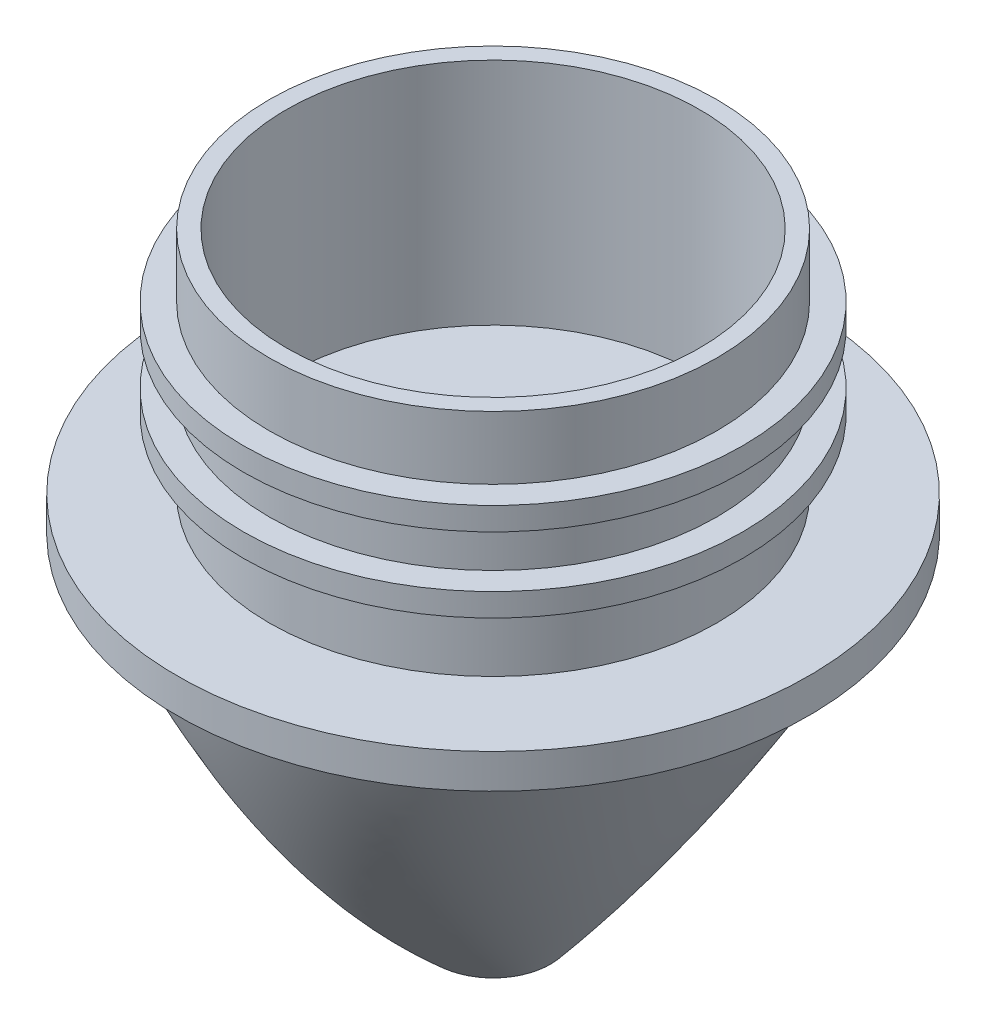
ISO-10303-21;
HEADER;
FILE_DESCRIPTION(('STEP AP214'),'2;1');
FILE_NAME('part.step','',(''),(''),'','','');
FILE_SCHEMA(('AUTOMOTIVE_DESIGN { 1 0 10303 214 1 1 1 1 }'));
ENDSEC;
DATA;
#1=APPLICATION_CONTEXT('core data for automotive mechanical design processes');
#2=APPLICATION_PROTOCOL_DEFINITION('international standard','automotive_design',2000,#1);
#3=PRODUCT_CONTEXT('',#1,'mechanical');
#4=PRODUCT('Part','Part','',(#3));
#5=PRODUCT_RELATED_PRODUCT_CATEGORY('part','',(#4));
#6=PRODUCT_DEFINITION_FORMATION('','',#4);
#7=PRODUCT_DEFINITION_CONTEXT('part definition',#1,'design');
#8=PRODUCT_DEFINITION('design','',#6,#7);
#9=PRODUCT_DEFINITION_SHAPE('','',#8);
#10=(LENGTH_UNIT() NAMED_UNIT(*) SI_UNIT(.MILLI.,.METRE.));
#11=(NAMED_UNIT(*) PLANE_ANGLE_UNIT() SI_UNIT($,.RADIAN.));
#12=(NAMED_UNIT(*) SI_UNIT($,.STERADIAN.) SOLID_ANGLE_UNIT());
#13=UNCERTAINTY_MEASURE_WITH_UNIT(LENGTH_MEASURE(1.E-05),#10,'distance_accuracy_value','');
#14=(GEOMETRIC_REPRESENTATION_CONTEXT(3) GLOBAL_UNCERTAINTY_ASSIGNED_CONTEXT((#13)) GLOBAL_UNIT_ASSIGNED_CONTEXT((#10,
#11,#12)) REPRESENTATION_CONTEXT('',''));
#15=CARTESIAN_POINT('',(0.,0.,0.));
#16=DIRECTION('',(0.,0.,1.));
#17=DIRECTION('',(1.,0.,0.));
#18=AXIS2_PLACEMENT_3D('',#15,#16,#17);
#19=CARTESIAN_POINT('',(0.,-23.4034123059416,-1.68146346259813));
#20=DIRECTION('',(-1.,0.,0.));
#21=DIRECTION('',(0.,0.,1.));
#22=AXIS2_PLACEMENT_3D('',#19,#20,#21);
#23=CIRCLE('',#22,11.6934361661484);
#24=TRIMMED_CURVE('',#23,(PARAMETER_VALUE(-1.42650061481023)),
(PARAMETER_VALUE(1.42650061481023)),.T.,.PARAMETER.);
#25=CARTESIAN_POINT('',(0.,-23.4034123059416,0.));
#26=DIRECTION('',(0.,1.,0.));
#27=AXIS1_PLACEMENT('',#25,#26);
#28=SURFACE_OF_REVOLUTION('',#24,#27);
#29=CARTESIAN_POINT('',(0.,-34.9753235567132,0.));
#30=VERTEX_POINT('',#29);
#31=VERTEX_LOOP('',#30);
#32=FACE_BOUND('',#31,.T.);
#33=CARTESIAN_POINT('',(0.,-33.,0.));
#34=DIRECTION('',(0.,1.,0.));
#35=DIRECTION('',(0.,0.,1.));
#36=AXIS2_PLACEMENT_3D('',#33,#34,#35);
#37=CIRCLE('',#36,5.);
#38=CARTESIAN_POINT('',(0.,-33.,5.));
#39=VERTEX_POINT('',#38);
#40=EDGE_CURVE('E14',#39,#39,#37,.T.);
#41=ORIENTED_EDGE('',*,*,#40,.F.);
#42=EDGE_LOOP('',(#41));
#43=FACE_BOUND('',#42,.T.);
#44=ADVANCED_FACE('F95',(#32,#43),#28,.T.);
#45=CARTESIAN_POINT('',(0.,-33.,5.));
#46=DIRECTION('',(0.,1.,0.));
#47=DIRECTION('',(0.,0.,1.));
#48=AXIS2_PLACEMENT_3D('',#45,#46,#47);
#49=PLANE('',#48);
#50=ORIENTED_EDGE('',*,*,#40,.T.);
#51=EDGE_LOOP('',(#50));
#52=FACE_BOUND('',#51,.T.);
#53=ADVANCED_FACE('F104',(#52),#49,.T.);
#54=CLOSED_SHELL('',(#44,#53));
#55=MANIFOLD_SOLID_BREP('B2',#54);
#56=CARTESIAN_POINT('',(0.,-33.,-5.));
#57=DIRECTION('',(0.,1.,-1.06741180562796E-13));
#58=DIRECTION('',(0.,1.06741180562796E-13,1.));
#59=AXIS2_PLACEMENT_3D('',#56,#57,#58);
#60=PLANE('',#59);
#61=CARTESIAN_POINT('',(0.,-33.,5.));
#62=CARTESIAN_POINT('',(-0.327249232137514,-33.,5.));
#63=CARTESIAN_POINT('',(-0.981680403977716,-33.,4.93499328124983));
#64=CARTESIAN_POINT('',(-2.24064053377986,-33.,4.55458579852169));
#65=CARTESIAN_POINT('',(-3.62771208725025,-32.9999999999999,3.62764916613364));
#66=CARTESIAN_POINT('',(-4.73979573179852,-33.,1.9633506312621));
#67=CARTESIAN_POINT('',(-5.13036592541444,-32.9999999999999,0.));
#68=CARTESIAN_POINT('',(-4.73979573179851,-33.0000000000001,-1.9633506312621));
#69=CARTESIAN_POINT('',(-3.62771208725026,-32.9999999999999,-3.62764916613364));
#70=CARTESIAN_POINT('',(-2.24064053377986,-33.,-4.55458579852169));
#71=CARTESIAN_POINT('',(-0.981680403977716,-33.,-4.93499328124983));
#72=CARTESIAN_POINT('',(-0.327249232137514,-33.,-5.));
#73=CARTESIAN_POINT('',(0.327249232137514,-33.,-5.));
#74=CARTESIAN_POINT('',(0.981680403977717,-33.,-4.93499328124983));
#75=CARTESIAN_POINT('',(2.24064053377986,-33.,-4.5545857985217));
#76=CARTESIAN_POINT('',(3.62771208725025,-32.9999999999999,-3.62764916613363));
#77=CARTESIAN_POINT('',(4.73979573179853,-33.,-1.9633506312621));
#78=CARTESIAN_POINT('',(5.13036592541442,-33.,0.));
#79=CARTESIAN_POINT('',(4.73979573179853,-33.,1.9633506312621));
#80=CARTESIAN_POINT('',(3.62771208725025,-33.,3.62764916613364));
#81=CARTESIAN_POINT('',(2.24064053377986,-33.,4.55458579852169));
#82=CARTESIAN_POINT('',(0.981680403977717,-33.,4.93499328124983));
#83=CARTESIAN_POINT('',(0.327249232137515,-33.,5.));
#84=CARTESIAN_POINT('',(0.,-33.,5.));
#85=B_SPLINE_CURVE_WITH_KNOTS('',3,(#61,#62,#63,#64,#65,#66,#67,#68,#69,#70,#71,#72,#73,#74,#75,
#76,#77,#78,#79,#80,#81,#82,#83,#84),.UNSPECIFIED.,.T.,.F.,(4,1,1,1,1,1,1,1,1,1,2,1,1,1,1,1,1,1,
1,1,4),(0.,0.03125,0.0625,0.125,0.1875,0.25,0.3125,0.375,0.4375,0.46875,0.5,0.53125,0.5625,
0.625,0.6875,0.75,0.8125,0.875,0.9375,0.96875,1.),.UNSPECIFIED.);
#86=CARTESIAN_POINT('',(0.,-33.,5.));
#87=VERTEX_POINT('',#86);
#88=EDGE_CURVE('E132',#87,#87,#85,.F.);
#89=ORIENTED_EDGE('',*,*,#88,.F.);
#90=EDGE_LOOP('',(#89));
#91=FACE_BOUND('',#90,.T.);
#92=ADVANCED_FACE('F129',(#91),#60,.F.);
#93=CARTESIAN_POINT('',(0.,-3.,-25.));
#94=DIRECTION('',(0.,1.,0.));
#95=DIRECTION('',(0.,0.,1.));
#96=AXIS2_PLACEMENT_3D('',#93,#94,#95);
#97=PLANE('',#96);
#98=CARTESIAN_POINT('',(0.,-3.,25.));
#99=CARTESIAN_POINT('',(-1.63624616068757,-3.,25.));
#100=CARTESIAN_POINT('',(-4.90813549192513,-3.,24.6765838751217));
#101=CARTESIAN_POINT('',(-11.2035179919908,-2.99999999999999,22.7715638139233));
#102=CARTESIAN_POINT('',(-18.1384091942729,-3.00000000000001,18.1389749409526));
#103=CARTESIAN_POINT('',(-23.6992576262852,-3.,9.81635374424561));
#104=CARTESIAN_POINT('',(-25.6515460302529,-2.99999999999999,0.));
#105=CARTESIAN_POINT('',(-23.6992576262853,-3.00000000000001,-9.81635374424557));
#106=CARTESIAN_POINT('',(-18.1384091942729,-3.,-18.1389749409527));
#107=CARTESIAN_POINT('',(-11.2035179919908,-3.,-22.7715638139232));
#108=CARTESIAN_POINT('',(-4.90813549192511,-3.,-24.6765838751217));
#109=CARTESIAN_POINT('',(-1.63624616068757,-3.,-25.));
#110=CARTESIAN_POINT('',(1.63624616068757,-3.,-25.));
#111=CARTESIAN_POINT('',(4.90813549192511,-3.,-24.6765838751217));
#112=CARTESIAN_POINT('',(11.2035179919908,-3.,-22.7715638139232));
#113=CARTESIAN_POINT('',(18.1384091942728,-3.,-18.1389749409527));
#114=CARTESIAN_POINT('',(23.6992576262853,-3.00000000000001,-9.81635374424558));
#115=CARTESIAN_POINT('',(25.6515460302528,-2.99999999999999,0.));
#116=CARTESIAN_POINT('',(23.6992576262852,-3.00000000000001,9.81635374424565));
#117=CARTESIAN_POINT('',(18.1384091942729,-3.,18.1389749409526));
#118=CARTESIAN_POINT('',(11.2035179919908,-3.00000000000001,22.7715638139233));
#119=CARTESIAN_POINT('',(4.90813549192513,-3.,24.6765838751217));
#120=CARTESIAN_POINT('',(1.63624616068757,-3.,25.));
#121=CARTESIAN_POINT('',(0.,-3.,25.));
#122=B_SPLINE_CURVE_WITH_KNOTS('',3,(#98,#99,#100,#101,#102,#103,#104,#105,#106,#107,#108,#109,
#110,#111,#112,#113,#114,#115,#116,#117,#118,#119,#120,#121),.UNSPECIFIED.,.T.,.F.,(4,1,1,1,1,1,
1,1,1,1,2,1,1,1,1,1,1,1,1,1,4),(0.,0.03125,0.0625,0.125,0.1875,0.25,0.3125,0.375,0.4375,0.46875,
0.5,0.53125,0.5625,0.625,0.6875,0.75,0.8125,0.875,0.9375,0.96875,1.),.UNSPECIFIED.);
#123=CARTESIAN_POINT('',(0.,-3.,25.));
#124=VERTEX_POINT('',#123);
#125=EDGE_CURVE('E94',#124,#124,#122,.T.);
#126=ORIENTED_EDGE('',*,*,#125,.F.);
#127=EDGE_LOOP('',(#126));
#128=FACE_BOUND('',#127,.T.);
#129=ADVANCED_FACE('F159',(#128),#97,.T.);
#130=CARTESIAN_POINT('',(0.,-3.,25.));
#131=CARTESIAN_POINT('',(0.,-14.5667957946294,21.0517209178654));
#132=CARTESIAN_POINT('',(0.,-24.9066670800951,14.1584733942216));
#133=CARTESIAN_POINT('',(0.,-33.,5.));
#134=CARTESIAN_POINT('',(-1.63624616068757,-3.,25.));
#135=CARTESIAN_POINT('',(-1.19991385117089,-14.5667957946294,21.0517209178654));
#136=CARTESIAN_POINT('',(-0.7635815416542,-24.9066670800951,14.1584733942216));
#137=CARTESIAN_POINT('',(-0.327249232137514,-33.,5.));
#138=CARTESIAN_POINT('',(-4.90813549192513,-3.,24.6765838751217));
#139=CARTESIAN_POINT('',(-3.59931712927599,-14.5667957946294,20.7719664556881));
#140=CARTESIAN_POINT('',(-2.29049876662685,-24.9066670800951,13.968395726644));
#141=CARTESIAN_POINT('',(-0.981680403977716,-33.,4.93499328124983));
#142=CARTESIAN_POINT('',(-11.2035179919908,-2.99999999999999,22.7715638139233));
#143=CARTESIAN_POINT('',(-8.21589217258713,-14.5667957946294,19.1415391542674));
#144=CARTESIAN_POINT('',(-5.2282663531835,-24.9066670800951,12.8656444104432));
#145=CARTESIAN_POINT('',(-2.24064053377986,-33.,4.55458579852169));
#146=CARTESIAN_POINT('',(-18.1384091942729,-3.00000000000001,18.1389749409526));
#147=CARTESIAN_POINT('',(-13.3015101585987,-14.5667957946294,15.2132326197204));
#148=CARTESIAN_POINT('',(-8.46461112292447,-24.906667080095,10.216809363052));
#149=CARTESIAN_POINT('',(-3.62771208725025,-32.9999999999999,3.62764916613364));
#150=CARTESIAN_POINT('',(-23.6992576262852,-3.,9.81635374424561));
#151=CARTESIAN_POINT('',(-17.3794369947897,-14.5667957946294,8.21808138411729));
#152=CARTESIAN_POINT('',(-11.0596163632941,-24.9066670800951,5.51544585842304));
#153=CARTESIAN_POINT('',(-4.73979573179852,-33.,1.9633506312621));
#154=CARTESIAN_POINT('',(-25.6515460302529,-2.99999999999999,0.));
#155=CARTESIAN_POINT('',(-18.8111526619734,-14.5667957946294,0.));
#156=CARTESIAN_POINT('',(-11.9707592936939,-24.906667080095,0.));
#157=CARTESIAN_POINT('',(-5.13036592541444,-32.9999999999999,0.));
#158=CARTESIAN_POINT('',(-23.6992576262853,-3.00000000000001,-9.81635374424557));
#159=CARTESIAN_POINT('',(-17.3794369947897,-14.5667957946295,-8.21808138411725));
#160=CARTESIAN_POINT('',(-11.0596163632941,-24.9066670800951,-5.51544585842303));
#161=CARTESIAN_POINT('',(-4.73979573179851,-33.0000000000001,-1.9633506312621));
#162=CARTESIAN_POINT('',(-18.1384091942729,-3.,-18.1389749409527));
#163=CARTESIAN_POINT('',(-13.3015101585987,-14.5667957946294,-15.2132326197204));
#164=CARTESIAN_POINT('',(-8.46461112292446,-24.906667080095,-10.2168093630521));
#165=CARTESIAN_POINT('',(-3.62771208725026,-32.9999999999999,-3.62764916613364));
#166=CARTESIAN_POINT('',(-11.2035179919908,-3.,-22.7715638139232));
#167=CARTESIAN_POINT('',(-8.21589217258715,-14.5667957946294,-19.1415391542674));
#168=CARTESIAN_POINT('',(-5.2282663531835,-24.9066670800951,-12.8656444104432));
#169=CARTESIAN_POINT('',(-2.24064053377986,-33.,-4.55458579852169));
#170=CARTESIAN_POINT('',(-4.90813549192511,-3.,-24.6765838751217));
#171=CARTESIAN_POINT('',(-3.59931712927598,-14.5667957946294,-20.7719664556881));
#172=CARTESIAN_POINT('',(-2.29049876662685,-24.9066670800951,-13.968395726644));
#173=CARTESIAN_POINT('',(-0.981680403977716,-33.,-4.93499328124983));
#174=CARTESIAN_POINT('',(-1.63624616068757,-3.,-25.));
#175=CARTESIAN_POINT('',(-1.19991385117089,-14.5667957946294,-21.0517209178653));
#176=CARTESIAN_POINT('',(-0.7635815416542,-24.9066670800951,-14.1584733942216));
#177=CARTESIAN_POINT('',(-0.327249232137514,-33.,-5.));
#178=CARTESIAN_POINT('',(1.63624616068757,-3.,-25.));
#179=CARTESIAN_POINT('',(1.19991385117089,-14.5667957946294,-21.0517209178653));
#180=CARTESIAN_POINT('',(0.7635815416542,-24.9066670800951,-14.1584733942216));
#181=CARTESIAN_POINT('',(0.327249232137514,-33.,-5.));
#182=CARTESIAN_POINT('',(4.90813549192511,-3.,-24.6765838751217));
#183=CARTESIAN_POINT('',(3.59931712927598,-14.5667957946294,-20.7719664556881));
#184=CARTESIAN_POINT('',(2.29049876662685,-24.9066670800951,-13.968395726644));
#185=CARTESIAN_POINT('',(0.981680403977717,-33.,-4.93499328124983));
#186=CARTESIAN_POINT('',(11.2035179919908,-3.,-22.7715638139232));
#187=CARTESIAN_POINT('',(8.21589217258716,-14.5667957946294,-19.1415391542674));
#188=CARTESIAN_POINT('',(5.22826635318351,-24.9066670800951,-12.8656444104432));
#189=CARTESIAN_POINT('',(2.24064053377986,-33.,-4.5545857985217));
#190=CARTESIAN_POINT('',(18.1384091942728,-3.,-18.1389749409527));
#191=CARTESIAN_POINT('',(13.3015101585986,-14.5667957946294,-15.2132326197204));
#192=CARTESIAN_POINT('',(8.46461112292443,-24.906667080095,-10.2168093630521));
#193=CARTESIAN_POINT('',(3.62771208725025,-32.9999999999999,-3.62764916613363));
#194=CARTESIAN_POINT('',(23.6992576262853,-3.00000000000001,-9.81635374424558));
#195=CARTESIAN_POINT('',(17.3794369947897,-14.5667957946294,-8.21808138411725));
#196=CARTESIAN_POINT('',(11.0596163632941,-24.9066670800951,-5.51544585842303));
#197=CARTESIAN_POINT('',(4.73979573179853,-33.,-1.9633506312621));
#198=CARTESIAN_POINT('',(25.6515460302528,-2.99999999999999,0.));
#199=CARTESIAN_POINT('',(18.8111526619734,-14.5667957946294,0.));
#200=CARTESIAN_POINT('',(11.9707592936939,-24.9066670800951,0.));
#201=CARTESIAN_POINT('',(5.13036592541442,-33.,0.));
#202=CARTESIAN_POINT('',(23.6992576262852,-3.00000000000001,9.81635374424565));
#203=CARTESIAN_POINT('',(17.3794369947897,-14.5667957946295,8.21808138411732));
#204=CARTESIAN_POINT('',(11.0596163632941,-24.9066670800951,5.51544585842305));
#205=CARTESIAN_POINT('',(4.73979573179853,-33.,1.9633506312621));
#206=CARTESIAN_POINT('',(18.1384091942729,-3.,18.1389749409526));
#207=CARTESIAN_POINT('',(13.3015101585987,-14.5667957946294,15.2132326197203));
#208=CARTESIAN_POINT('',(8.46461112292447,-24.9066670800951,10.216809363052));
#209=CARTESIAN_POINT('',(3.62771208725025,-33.,3.62764916613364));
#210=CARTESIAN_POINT('',(11.2035179919908,-3.00000000000001,22.7715638139233));
#211=CARTESIAN_POINT('',(8.21589217258715,-14.5667957946294,19.1415391542674));
#212=CARTESIAN_POINT('',(5.2282663531835,-24.9066670800951,12.8656444104432));
#213=CARTESIAN_POINT('',(2.24064053377986,-33.,4.55458579852169));
#214=CARTESIAN_POINT('',(4.90813549192513,-3.,24.6765838751217));
#215=CARTESIAN_POINT('',(3.59931712927599,-14.5667957946294,20.7719664556881));
#216=CARTESIAN_POINT('',(2.29049876662685,-24.9066670800951,13.968395726644));
#217=CARTESIAN_POINT('',(0.981680403977717,-33.,4.93499328124983));
#218=CARTESIAN_POINT('',(1.63624616068757,-3.,25.));
#219=CARTESIAN_POINT('',(1.19991385117089,-14.5667957946294,21.0517209178654));
#220=CARTESIAN_POINT('',(0.7635815416542,-24.9066670800951,14.1584733942216));
#221=CARTESIAN_POINT('',(0.327249232137515,-33.,5.));
#222=CARTESIAN_POINT('',(0.,-3.,25.));
#223=CARTESIAN_POINT('',(0.,-14.5667957946294,21.0517209178654));
#224=CARTESIAN_POINT('',(0.,-24.9066670800951,14.1584733942216));
#225=CARTESIAN_POINT('',(0.,-33.,5.));
#226=B_SPLINE_SURFACE_WITH_KNOTS('',3,3,((#130,#131,#132,#133),(#134,#135,#136,#137),(#138,#139,
#140,#141),(#142,#143,#144,#145),(#146,#147,#148,#149),(#150,#151,#152,#153),(#154,#155,#156,
#157),(#158,#159,#160,#161),(#162,#163,#164,#165),(#166,#167,#168,#169),(#170,#171,#172,#173),
(#174,#175,#176,#177),(#178,#179,#180,#181),(#182,#183,#184,#185),(#186,#187,#188,#189),(#190,
#191,#192,#193),(#194,#195,#196,#197),(#198,#199,#200,#201),(#202,#203,#204,#205),(#206,#207,
#208,#209),(#210,#211,#212,#213),(#214,#215,#216,#217),(#218,#219,#220,#221),(#222,#223,#224,
#225)),.UNSPECIFIED.,.T.,.F.,.F.,(4,1,1,1,1,1,1,1,1,1,2,1,1,1,1,1,1,1,1,1,4),(4,4),(0.,0.03125,
0.0625,0.125,0.1875,0.25,0.3125,0.375,0.4375,0.46875,0.5,0.53125,0.5625,0.625,0.6875,0.75,
0.8125,0.875,0.9375,0.96875,1.),(0.,1.),.UNSPECIFIED.);
#227=ORIENTED_EDGE('',*,*,#125,.T.);
#228=EDGE_LOOP('',(#227));
#229=FACE_BOUND('',#228,.T.);
#230=ORIENTED_EDGE('',*,*,#88,.T.);
#231=EDGE_LOOP('',(#230));
#232=FACE_BOUND('',#231,.T.);
#233=ADVANCED_FACE('F156',(#229,#232),#226,.T.);
#234=OPEN_SHELL('',(#92,#129,#233));
#235=SHELL_BASED_SURFACE_MODEL('B8',(#234));
#236=CARTESIAN_POINT('',(0.,0.,0.));
#237=DIRECTION('',(0.,-1.,0.));
#238=DIRECTION('',(0.,0.,-1.));
#239=AXIS2_PLACEMENT_3D('',#236,#237,#238);
#240=PLANE('',#239);
#241=CARTESIAN_POINT('',(0.,0.,0.));
#242=DIRECTION('',(0.,1.,0.));
#243=DIRECTION('',(0.,0.,1.));
#244=AXIS2_PLACEMENT_3D('',#241,#242,#243);
#245=CIRCLE('',#244,18.);
#246=CARTESIAN_POINT('',(0.,0.,18.));
#247=VERTEX_POINT('',#246);
#248=EDGE_CURVE('E242',#247,#247,#245,.T.);
#249=ORIENTED_EDGE('',*,*,#248,.T.);
#250=EDGE_LOOP('',(#249));
#251=FACE_BOUND('',#250,.T.);
#252=ADVANCED_FACE('F201',(#251),#240,.F.);
#253=CARTESIAN_POINT('',(0.,20.,0.));
#254=DIRECTION('',(0.,-1.,0.));
#255=DIRECTION('',(0.,0.,-1.));
#256=AXIS2_PLACEMENT_3D('',#253,#254,#255);
#257=CYLINDRICAL_SURFACE('',#256,19.5);
#258=CARTESIAN_POINT('',(0.,8.,0.));
#259=DIRECTION('',(0.,1.,0.));
#260=DIRECTION('',(0.,0.,1.));
#261=AXIS2_PLACEMENT_3D('',#258,#259,#260);
#262=CIRCLE('',#261,19.5);
#263=CARTESIAN_POINT('',(0.,8.,19.5));
#264=VERTEX_POINT('',#263);
#265=EDGE_CURVE('E228',#264,#264,#262,.T.);
#266=ORIENTED_EDGE('',*,*,#265,.T.);
#267=EDGE_LOOP('',(#266));
#268=FACE_BOUND('',#267,.T.);
#269=CARTESIAN_POINT('',(0.,12.5,0.));
#270=DIRECTION('',(0.,1.,0.));
#271=DIRECTION('',(0.,0.,1.));
#272=AXIS2_PLACEMENT_3D('',#269,#270,#271);
#273=CIRCLE('',#272,19.5);
#274=CARTESIAN_POINT('',(0.,12.5,19.5));
#275=VERTEX_POINT('',#274);
#276=EDGE_CURVE('E128',#275,#275,#273,.T.);
#277=ORIENTED_EDGE('',*,*,#276,.F.);
#278=EDGE_LOOP('',(#277));
#279=FACE_BOUND('',#278,.T.);
#280=ADVANCED_FACE('F253',(#268,#279),#257,.T.);
#281=CARTESIAN_POINT('',(0.,0.,0.));
#282=DIRECTION('',(0.,1.,0.));
#283=DIRECTION('',(0.,0.,1.));
#284=AXIS2_PLACEMENT_3D('',#281,#282,#283);
#285=CIRCLE('',#284,19.5);
#286=CARTESIAN_POINT('',(0.,0.,19.5));
#287=VERTEX_POINT('',#286);
#288=EDGE_CURVE('E205',#287,#287,#285,.T.);
#289=ORIENTED_EDGE('',*,*,#288,.T.);
#290=EDGE_LOOP('',(#289));
#291=FACE_BOUND('',#290,.T.);
#292=CARTESIAN_POINT('',(0.,6.,0.));
#293=DIRECTION('',(0.,1.,0.));
#294=DIRECTION('',(0.,0.,1.));
#295=AXIS2_PLACEMENT_3D('',#292,#293,#294);
#296=CIRCLE('',#295,19.5);
#297=CARTESIAN_POINT('',(0.,6.,19.5));
#298=VERTEX_POINT('',#297);
#299=EDGE_CURVE('E209',#298,#298,#296,.T.);
#300=ORIENTED_EDGE('',*,*,#299,.F.);
#301=EDGE_LOOP('',(#300));
#302=FACE_BOUND('',#301,.T.);
#303=ADVANCED_FACE('F254',(#291,#302),#257,.T.);
#304=CARTESIAN_POINT('',(0.,-3.,0.));
#305=DIRECTION('',(0.,1.,0.));
#306=DIRECTION('',(0.,0.,1.));
#307=AXIS2_PLACEMENT_3D('',#304,#305,#306);
#308=CYLINDRICAL_SURFACE('',#307,27.5);
#309=CARTESIAN_POINT('',(0.,-3.,0.));
#310=DIRECTION('',(0.,-1.,0.));
#311=DIRECTION('',(0.,0.,-1.));
#312=AXIS2_PLACEMENT_3D('',#309,#310,#311);
#313=CIRCLE('',#312,27.5);
#314=CARTESIAN_POINT('',(0.,-3.,-27.5));
#315=VERTEX_POINT('',#314);
#316=EDGE_CURVE('E234',#315,#315,#313,.T.);
#317=ORIENTED_EDGE('',*,*,#316,.F.);
#318=EDGE_LOOP('',(#317));
#319=FACE_BOUND('',#318,.T.);
#320=CARTESIAN_POINT('',(0.,0.,0.));
#321=DIRECTION('',(0.,-1.,0.));
#322=DIRECTION('',(0.,0.,-1.));
#323=AXIS2_PLACEMENT_3D('',#320,#321,#322);
#324=CIRCLE('',#323,27.5);
#325=CARTESIAN_POINT('',(0.,0.,-27.5));
#326=VERTEX_POINT('',#325);
#327=EDGE_CURVE('E232',#326,#326,#324,.T.);
#328=ORIENTED_EDGE('',*,*,#327,.T.);
#329=EDGE_LOOP('',(#328));
#330=FACE_BOUND('',#329,.T.);
#331=ADVANCED_FACE('F265',(#319,#330),#308,.T.);
#332=CARTESIAN_POINT('',(0.,-3.,0.));
#333=DIRECTION('',(0.,-1.,0.));
#334=DIRECTION('',(0.,0.,-1.));
#335=AXIS2_PLACEMENT_3D('',#332,#333,#334);
#336=PLANE('',#335);
#337=ORIENTED_EDGE('',*,*,#316,.T.);
#338=EDGE_LOOP('',(#337));
#339=FACE_BOUND('',#338,.T.);
#340=ADVANCED_FACE('F277',(#339),#336,.T.);
#341=ORIENTED_EDGE('',*,*,#288,.F.);
#342=EDGE_LOOP('',(#341));
#343=FACE_BOUND('',#342,.T.);
#344=ORIENTED_EDGE('',*,*,#327,.F.);
#345=EDGE_LOOP('',(#344));
#346=FACE_BOUND('',#345,.T.);
#347=ADVANCED_FACE('F270',(#343,#346),#240,.F.);
#348=CARTESIAN_POINT('',(0.,6.,0.));
#349=DIRECTION('',(0.,1.,0.));
#350=DIRECTION('',(0.,0.,1.));
#351=AXIS2_PLACEMENT_3D('',#348,#349,#350);
#352=CYLINDRICAL_SURFACE('',#351,21.75);
#353=CARTESIAN_POINT('',(0.,6.,0.));
#354=DIRECTION('',(0.,1.,0.));
#355=DIRECTION('',(0.,0.,1.));
#356=AXIS2_PLACEMENT_3D('',#353,#354,#355);
#357=CIRCLE('',#356,21.75);
#358=CARTESIAN_POINT('',(0.,6.,21.75));
#359=VERTEX_POINT('',#358);
#360=EDGE_CURVE('E225',#359,#359,#357,.T.);
#361=ORIENTED_EDGE('',*,*,#360,.T.);
#362=EDGE_LOOP('',(#361));
#363=FACE_BOUND('',#362,.T.);
#364=CARTESIAN_POINT('',(0.,8.,0.));
#365=DIRECTION('',(0.,1.,0.));
#366=DIRECTION('',(0.,0.,1.));
#367=AXIS2_PLACEMENT_3D('',#364,#365,#366);
#368=CIRCLE('',#367,21.75);
#369=CARTESIAN_POINT('',(0.,8.,21.75));
#370=VERTEX_POINT('',#369);
#371=EDGE_CURVE('E223',#370,#370,#368,.T.);
#372=ORIENTED_EDGE('',*,*,#371,.F.);
#373=EDGE_LOOP('',(#372));
#374=FACE_BOUND('',#373,.T.);
#375=ADVANCED_FACE('F276',(#363,#374),#352,.T.);
#376=CARTESIAN_POINT('',(0.,6.,0.));
#377=DIRECTION('',(0.,1.,0.));
#378=DIRECTION('',(0.,0.,1.));
#379=AXIS2_PLACEMENT_3D('',#376,#377,#378);
#380=PLANE('',#379);
#381=ORIENTED_EDGE('',*,*,#299,.T.);
#382=EDGE_LOOP('',(#381));
#383=FACE_BOUND('',#382,.T.);
#384=ORIENTED_EDGE('',*,*,#360,.F.);
#385=EDGE_LOOP('',(#384));
#386=FACE_BOUND('',#385,.T.);
#387=ADVANCED_FACE('F283',(#383,#386),#380,.F.);
#388=CARTESIAN_POINT('',(0.,8.,0.));
#389=DIRECTION('',(0.,1.,0.));
#390=DIRECTION('',(0.,0.,1.));
#391=AXIS2_PLACEMENT_3D('',#388,#389,#390);
#392=PLANE('',#391);
#393=ORIENTED_EDGE('',*,*,#265,.F.);
#394=EDGE_LOOP('',(#393));
#395=FACE_BOUND('',#394,.T.);
#396=ORIENTED_EDGE('',*,*,#371,.T.);
#397=EDGE_LOOP('',(#396));
#398=FACE_BOUND('',#397,.T.);
#399=ADVANCED_FACE('F350',(#395,#398),#392,.T.);
#400=CARTESIAN_POINT('',(0.,14.5,0.));
#401=DIRECTION('',(0.,-1.,0.));
#402=DIRECTION('',(0.,0.,-1.));
#403=AXIS2_PLACEMENT_3D('',#400,#401,#402);
#404=CYLINDRICAL_SURFACE('',#403,21.75);
#405=CARTESIAN_POINT('',(0.,14.5,0.));
#406=DIRECTION('',(0.,1.,0.));
#407=DIRECTION('',(0.,0.,1.));
#408=AXIS2_PLACEMENT_3D('',#405,#406,#407);
#409=CIRCLE('',#408,21.75);
#410=CARTESIAN_POINT('',(0.,14.5,21.75));
#411=VERTEX_POINT('',#410);
#412=EDGE_CURVE('E224',#411,#411,#409,.T.);
#413=ORIENTED_EDGE('',*,*,#412,.F.);
#414=EDGE_LOOP('',(#413));
#415=FACE_BOUND('',#414,.T.);
#416=CARTESIAN_POINT('',(0.,12.5,0.));
#417=DIRECTION('',(0.,1.,0.));
#418=DIRECTION('',(0.,0.,1.));
#419=AXIS2_PLACEMENT_3D('',#416,#417,#418);
#420=CIRCLE('',#419,21.75);
#421=CARTESIAN_POINT('',(0.,12.5,21.75));
#422=VERTEX_POINT('',#421);
#423=EDGE_CURVE('E218',#422,#422,#420,.T.);
#424=ORIENTED_EDGE('',*,*,#423,.T.);
#425=EDGE_LOOP('',(#424));
#426=FACE_BOUND('',#425,.T.);
#427=ADVANCED_FACE('F360',(#415,#426),#404,.T.);
#428=CARTESIAN_POINT('',(0.,14.5,0.));
#429=DIRECTION('',(0.,1.,0.));
#430=DIRECTION('',(0.,0.,1.));
#431=AXIS2_PLACEMENT_3D('',#428,#429,#430);
#432=PLANE('',#431);
#433=CARTESIAN_POINT('',(0.,14.5,0.));
#434=DIRECTION('',(0.,1.,0.));
#435=DIRECTION('',(0.,0.,1.));
#436=AXIS2_PLACEMENT_3D('',#433,#434,#435);
#437=CIRCLE('',#436,19.5);
#438=CARTESIAN_POINT('',(0.,14.5,19.5));
#439=VERTEX_POINT('',#438);
#440=EDGE_CURVE('E220',#439,#439,#437,.T.);
#441=ORIENTED_EDGE('',*,*,#440,.F.);
#442=EDGE_LOOP('',(#441));
#443=FACE_BOUND('',#442,.T.);
#444=ORIENTED_EDGE('',*,*,#412,.T.);
#445=EDGE_LOOP('',(#444));
#446=FACE_BOUND('',#445,.T.);
#447=ADVANCED_FACE('F260',(#443,#446),#432,.T.);
#448=CARTESIAN_POINT('',(0.,12.5,0.));
#449=DIRECTION('',(0.,1.,0.));
#450=DIRECTION('',(0.,0.,1.));
#451=AXIS2_PLACEMENT_3D('',#448,#449,#450);
#452=PLANE('',#451);
#453=ORIENTED_EDGE('',*,*,#276,.T.);
#454=EDGE_LOOP('',(#453));
#455=FACE_BOUND('',#454,.T.);
#456=ORIENTED_EDGE('',*,*,#423,.F.);
#457=EDGE_LOOP('',(#456));
#458=FACE_BOUND('',#457,.T.);
#459=ADVANCED_FACE('F251',(#455,#458),#452,.F.);
#460=ORIENTED_EDGE('',*,*,#440,.T.);
#461=EDGE_LOOP('',(#460));
#462=FACE_BOUND('',#461,.T.);
#463=CARTESIAN_POINT('',(0.,20.,0.));
#464=DIRECTION('',(0.,1.,0.));
#465=DIRECTION('',(0.,0.,1.));
#466=AXIS2_PLACEMENT_3D('',#463,#464,#465);
#467=CIRCLE('',#466,19.5);
#468=CARTESIAN_POINT('',(0.,20.,19.5));
#469=VERTEX_POINT('',#468);
#470=EDGE_CURVE('E214',#469,#469,#467,.T.);
#471=ORIENTED_EDGE('',*,*,#470,.F.);
#472=EDGE_LOOP('',(#471));
#473=FACE_BOUND('',#472,.T.);
#474=ADVANCED_FACE('F203',(#462,#473),#257,.T.);
#475=CARTESIAN_POINT('',(0.,20.,0.));
#476=DIRECTION('',(0.,1.,0.));
#477=DIRECTION('',(0.,0.,1.));
#478=AXIS2_PLACEMENT_3D('',#475,#476,#477);
#479=PLANE('',#478);
#480=ORIENTED_EDGE('',*,*,#470,.T.);
#481=EDGE_LOOP('',(#480));
#482=FACE_BOUND('',#481,.T.);
#483=CARTESIAN_POINT('',(0.,20.,0.));
#484=DIRECTION('',(0.,1.,0.));
#485=DIRECTION('',(0.,0.,1.));
#486=AXIS2_PLACEMENT_3D('',#483,#484,#485);
#487=CIRCLE('',#486,18.);
#488=CARTESIAN_POINT('',(0.,20.,18.));
#489=VERTEX_POINT('',#488);
#490=EDGE_CURVE('E239',#489,#489,#487,.T.);
#491=ORIENTED_EDGE('',*,*,#490,.F.);
#492=EDGE_LOOP('',(#491));
#493=FACE_BOUND('',#492,.T.);
#494=ADVANCED_FACE('F247',(#482,#493),#479,.T.);
#495=CARTESIAN_POINT('',(0.,20.,0.));
#496=DIRECTION('',(0.,-1.,0.));
#497=DIRECTION('',(0.,0.,-1.));
#498=AXIS2_PLACEMENT_3D('',#495,#496,#497);
#499=CYLINDRICAL_SURFACE('',#498,18.);
#500=ORIENTED_EDGE('',*,*,#490,.T.);
#501=EDGE_LOOP('',(#500));
#502=FACE_BOUND('',#501,.T.);
#503=ORIENTED_EDGE('',*,*,#248,.F.);
#504=EDGE_LOOP('',(#503));
#505=FACE_BOUND('',#504,.T.);
#506=ADVANCED_FACE('F259',(#502,#505),#499,.F.);
#507=CLOSED_SHELL('',(#252,#280,#303,#331,#340,#347,#375,#387,#399,#427,#447,#459,#474,#494,#506));
#508=MANIFOLD_SOLID_BREP('B89',#507);
#509=ADVANCED_BREP_SHAPE_REPRESENTATION('',(#18,#55,#508),#14);
#510=MANIFOLD_SURFACE_SHAPE_REPRESENTATION('',(#18,#235),#14);
#511=SHAPE_REPRESENTATION('',(#18),#14);
#512=SHAPE_DEFINITION_REPRESENTATION(#9,#511);
#513=SHAPE_REPRESENTATION_RELATIONSHIP('','',#511,#509);
#514=SHAPE_REPRESENTATION_RELATIONSHIP('','',#511,#510);
ENDSEC;
END-ISO-10303-21;
